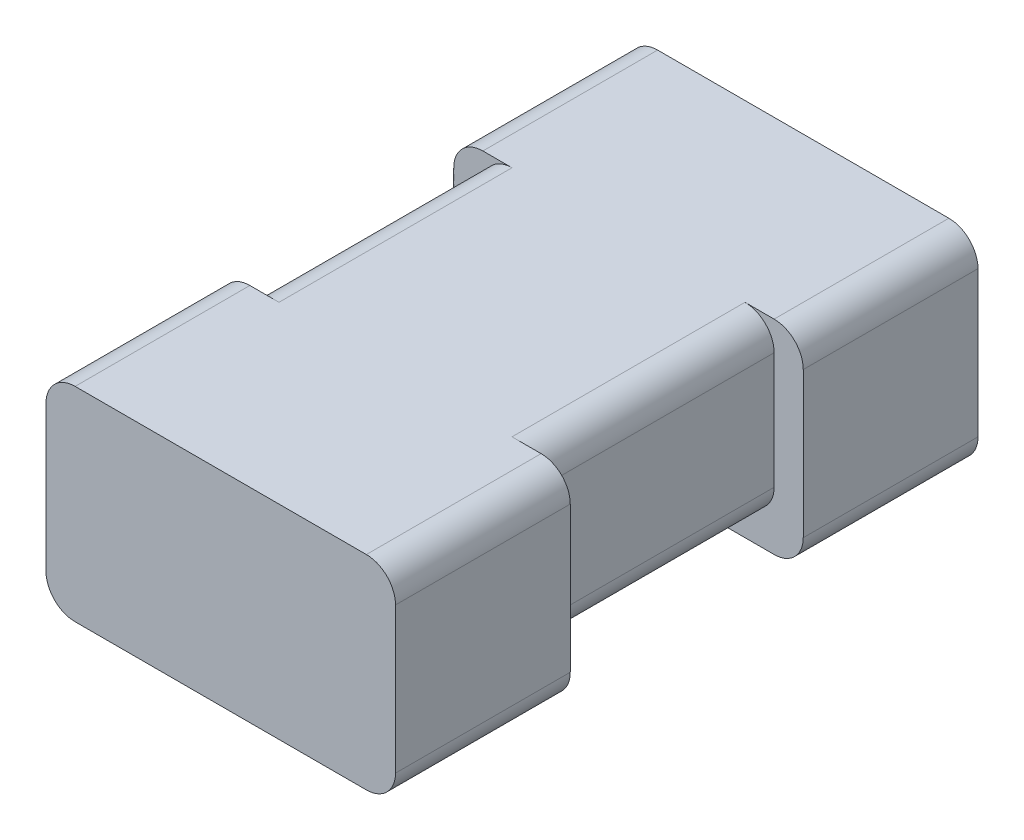
ISO-10303-21;
HEADER;
FILE_DESCRIPTION(('STEP AP214'),'2;1');
FILE_NAME('part.step','',(''),(''),'','','');
FILE_SCHEMA(('AUTOMOTIVE_DESIGN { 1 0 10303 214 1 1 1 1 }'));
ENDSEC;
DATA;
#1=APPLICATION_CONTEXT('core data for automotive mechanical design processes');
#2=APPLICATION_PROTOCOL_DEFINITION('international standard','automotive_design',2000,#1);
#3=PRODUCT_CONTEXT('',#1,'mechanical');
#4=PRODUCT('Part','Part','',(#3));
#5=PRODUCT_RELATED_PRODUCT_CATEGORY('part','',(#4));
#6=PRODUCT_DEFINITION_FORMATION('','',#4);
#7=PRODUCT_DEFINITION_CONTEXT('part definition',#1,'design');
#8=PRODUCT_DEFINITION('design','',#6,#7);
#9=PRODUCT_DEFINITION_SHAPE('','',#8);
#10=(LENGTH_UNIT() NAMED_UNIT(*) SI_UNIT(.MILLI.,.METRE.));
#11=(NAMED_UNIT(*) PLANE_ANGLE_UNIT() SI_UNIT($,.RADIAN.));
#12=(NAMED_UNIT(*) SI_UNIT($,.STERADIAN.) SOLID_ANGLE_UNIT());
#13=UNCERTAINTY_MEASURE_WITH_UNIT(LENGTH_MEASURE(1.E-05),#10,'distance_accuracy_value','');
#14=(GEOMETRIC_REPRESENTATION_CONTEXT(3) GLOBAL_UNCERTAINTY_ASSIGNED_CONTEXT((#13)) GLOBAL_UNIT_ASSIGNED_CONTEXT((#10,
#11,#12)) REPRESENTATION_CONTEXT('',''));
#15=CARTESIAN_POINT('',(0.,0.,0.));
#16=DIRECTION('',(0.,0.,1.));
#17=DIRECTION('',(1.,0.,0.));
#18=AXIS2_PLACEMENT_3D('',#15,#16,#17);
#19=CARTESIAN_POINT('',(0.,0.,0.4));
#20=DIRECTION('',(1.,0.,0.));
#21=DIRECTION('',(0.,1.,0.));
#22=AXIS2_PLACEMENT_3D('',#19,#20,#21);
#23=PLANE('',#22);
#24=DIRECTION('',(0.,-1.,0.));
#25=VECTOR('',#24,1.);
#26=CARTESIAN_POINT('',(0.,0.,0.));
#27=LINE('',#26,#25);
#28=CARTESIAN_POINT('',(0.,-0.05,0.));
#29=VERTEX_POINT('',#28);
#30=CARTESIAN_POINT('',(0.,-0.25,0.));
#31=VERTEX_POINT('',#30);
#32=EDGE_CURVE('E450',#29,#31,#27,.T.);
#33=ORIENTED_EDGE('',*,*,#32,.T.);
#34=DIRECTION('',(0.,0.,-1.));
#35=VECTOR('',#34,1.);
#36=CARTESIAN_POINT('',(0.,-0.25,0.4));
#37=LINE('',#36,#35);
#38=CARTESIAN_POINT('',(0.,-0.25,0.4));
#39=VERTEX_POINT('',#38);
#40=EDGE_CURVE('E309',#31,#39,#37,.F.);
#41=ORIENTED_EDGE('',*,*,#40,.T.);
#42=DIRECTION('',(0.,-1.,0.));
#43=VECTOR('',#42,1.);
#44=CARTESIAN_POINT('',(0.,0.,0.4));
#45=LINE('',#44,#43);
#46=CARTESIAN_POINT('',(0.,-0.05,0.4));
#47=VERTEX_POINT('',#46);
#48=EDGE_CURVE('E283',#47,#39,#45,.T.);
#49=ORIENTED_EDGE('',*,*,#48,.F.);
#50=DIRECTION('',(0.,0.,-1.));
#51=VECTOR('',#50,1.);
#52=CARTESIAN_POINT('',(0.,-0.05,0.4));
#53=LINE('',#52,#51);
#54=EDGE_CURVE('E305',#47,#29,#53,.T.);
#55=ORIENTED_EDGE('',*,*,#54,.T.);
#56=EDGE_LOOP('',(#33,#41,#49,#55));
#57=FACE_BOUND('',#56,.T.);
#58=ADVANCED_FACE('F42',(#57),#23,.F.);
#59=CARTESIAN_POINT('',(0.,-0.3,0.4));
#60=DIRECTION('',(0.,1.,0.));
#61=DIRECTION('',(0.,0.,1.));
#62=AXIS2_PLACEMENT_3D('',#59,#60,#61);
#63=PLANE('',#62);
#64=DIRECTION('',(1.,0.,0.));
#65=VECTOR('',#64,1.);
#66=CARTESIAN_POINT('',(0.,-0.3,0.));
#67=LINE('',#66,#65);
#68=CARTESIAN_POINT('',(0.05,-0.3,0.));
#69=VERTEX_POINT('',#68);
#70=CARTESIAN_POINT('',(0.45,-0.3,0.));
#71=VERTEX_POINT('',#70);
#72=EDGE_CURVE('E284',#69,#71,#67,.T.);
#73=ORIENTED_EDGE('',*,*,#72,.T.);
#74=DIRECTION('',(0.,0.,-1.));
#75=VECTOR('',#74,1.);
#76=CARTESIAN_POINT('',(0.45,-0.3,0.4));
#77=LINE('',#76,#75);
#78=CARTESIAN_POINT('',(0.45,-0.3,0.4));
#79=VERTEX_POINT('',#78);
#80=EDGE_CURVE('E302',#71,#79,#77,.F.);
#81=ORIENTED_EDGE('',*,*,#80,.T.);
#82=DIRECTION('',(1.,0.,0.));
#83=VECTOR('',#82,1.);
#84=CARTESIAN_POINT('',(0.,-0.3,0.4));
#85=LINE('',#84,#83);
#86=CARTESIAN_POINT('',(0.05,-0.3,0.4));
#87=VERTEX_POINT('',#86);
#88=EDGE_CURVE('E463',#87,#79,#85,.T.);
#89=ORIENTED_EDGE('',*,*,#88,.F.);
#90=DIRECTION('',(0.,0.,-1.));
#91=VECTOR('',#90,1.);
#92=CARTESIAN_POINT('',(0.05,-0.3,0.4));
#93=LINE('',#92,#91);
#94=EDGE_CURVE('E293',#87,#69,#93,.T.);
#95=ORIENTED_EDGE('',*,*,#94,.T.);
#96=EDGE_LOOP('',(#73,#81,#89,#95));
#97=FACE_BOUND('',#96,.T.);
#98=ADVANCED_FACE('F515',(#97),#63,.F.);
#99=CARTESIAN_POINT('',(0.5,0.,0.4));
#100=DIRECTION('',(-1.,0.,0.));
#101=DIRECTION('',(0.,0.,1.));
#102=AXIS2_PLACEMENT_3D('',#99,#100,#101);
#103=PLANE('',#102);
#104=DIRECTION('',(0.,1.,0.));
#105=VECTOR('',#104,1.);
#106=CARTESIAN_POINT('',(0.5,0.,0.4));
#107=LINE('',#106,#105);
#108=CARTESIAN_POINT('',(0.5,-0.25,0.4));
#109=VERTEX_POINT('',#108);
#110=CARTESIAN_POINT('',(0.5,-0.05,0.4));
#111=VERTEX_POINT('',#110);
#112=EDGE_CURVE('E467',#109,#111,#107,.T.);
#113=ORIENTED_EDGE('',*,*,#112,.F.);
#114=DIRECTION('',(0.,0.,-1.));
#115=VECTOR('',#114,1.);
#116=CARTESIAN_POINT('',(0.5,-0.25,0.4));
#117=LINE('',#116,#115);
#118=CARTESIAN_POINT('',(0.5,-0.25,0.));
#119=VERTEX_POINT('',#118);
#120=EDGE_CURVE('E281',#109,#119,#117,.T.);
#121=ORIENTED_EDGE('',*,*,#120,.T.);
#122=DIRECTION('',(0.,1.,0.));
#123=VECTOR('',#122,1.);
#124=CARTESIAN_POINT('',(0.5,0.,0.));
#125=LINE('',#124,#123);
#126=CARTESIAN_POINT('',(0.5,-0.05,0.));
#127=VERTEX_POINT('',#126);
#128=EDGE_CURVE('E271',#119,#127,#125,.T.);
#129=ORIENTED_EDGE('',*,*,#128,.T.);
#130=DIRECTION('',(0.,0.,-1.));
#131=VECTOR('',#130,1.);
#132=CARTESIAN_POINT('',(0.5,-0.05,0.4));
#133=LINE('',#132,#131);
#134=EDGE_CURVE('E278',#127,#111,#133,.F.);
#135=ORIENTED_EDGE('',*,*,#134,.T.);
#136=EDGE_LOOP('',(#113,#121,#129,#135));
#137=FACE_BOUND('',#136,.T.);
#138=ADVANCED_FACE('F277',(#137),#103,.F.);
#139=CARTESIAN_POINT('',(0.,0.,0.4));
#140=DIRECTION('',(0.,-1.,0.));
#141=DIRECTION('',(0.,0.,-1.));
#142=AXIS2_PLACEMENT_3D('',#139,#140,#141);
#143=PLANE('',#142);
#144=DIRECTION('',(-1.,0.,0.));
#145=VECTOR('',#144,1.);
#146=CARTESIAN_POINT('',(-0.05,0.,0.7));
#147=LINE('',#146,#145);
#148=CARTESIAN_POINT('',(0.5,0.,0.7));
#149=VERTEX_POINT('',#148);
#150=CARTESIAN_POINT('',(0.,0.,0.7));
#151=VERTEX_POINT('',#150);
#152=EDGE_CURVE('E447',#149,#151,#147,.T.);
#153=ORIENTED_EDGE('',*,*,#152,.F.);
#154=DIRECTION('',(0.,0.,-1.));
#155=VECTOR('',#154,1.);
#156=CARTESIAN_POINT('',(0.5,0.,0.4));
#157=LINE('',#156,#155);
#158=CARTESIAN_POINT('',(0.5,0.,0.4));
#159=VERTEX_POINT('',#158);
#160=EDGE_CURVE('E247',#149,#159,#157,.T.);
#161=ORIENTED_EDGE('',*,*,#160,.T.);
#162=DIRECTION('',(-1.,0.,0.));
#163=VECTOR('',#162,1.);
#164=CARTESIAN_POINT('',(-0.05,0.,0.4));
#165=LINE('',#164,#163);
#166=CARTESIAN_POINT('',(0.45,0.,0.4));
#167=VERTEX_POINT('',#166);
#168=EDGE_CURVE('E244',#159,#167,#165,.T.);
#169=ORIENTED_EDGE('',*,*,#168,.T.);
#170=DIRECTION('',(0.,0.,-1.));
#171=VECTOR('',#170,1.);
#172=CARTESIAN_POINT('',(0.45,0.,0.4));
#173=LINE('',#172,#171);
#174=CARTESIAN_POINT('',(0.45,0.,0.));
#175=VERTEX_POINT('',#174);
#176=EDGE_CURVE('E215',#167,#175,#173,.T.);
#177=ORIENTED_EDGE('',*,*,#176,.T.);
#178=DIRECTION('',(1.,0.,0.));
#179=VECTOR('',#178,1.);
#180=CARTESIAN_POINT('',(0.55,0.,0.));
#181=LINE('',#180,#179);
#182=CARTESIAN_POINT('',(0.5,0.,0.));
#183=VERTEX_POINT('',#182);
#184=EDGE_CURVE('E205',#175,#183,#181,.T.);
#185=ORIENTED_EDGE('',*,*,#184,.T.);
#186=DIRECTION('',(0.,0.,1.));
#187=VECTOR('',#186,1.);
#188=CARTESIAN_POINT('',(0.5,0.,0.4));
#189=LINE('',#188,#187);
#190=CARTESIAN_POINT('',(0.5,0.,-0.3));
#191=VERTEX_POINT('',#190);
#192=EDGE_CURVE('E211',#183,#191,#189,.F.);
#193=ORIENTED_EDGE('',*,*,#192,.T.);
#194=DIRECTION('',(1.,0.,0.));
#195=VECTOR('',#194,1.);
#196=CARTESIAN_POINT('',(0.55,0.,-0.3));
#197=LINE('',#196,#195);
#198=CARTESIAN_POINT('',(0.,0.,-0.3));
#199=VERTEX_POINT('',#198);
#200=EDGE_CURVE('E427',#199,#191,#197,.T.);
#201=ORIENTED_EDGE('',*,*,#200,.F.);
#202=DIRECTION('',(0.,0.,1.));
#203=VECTOR('',#202,1.);
#204=CARTESIAN_POINT('',(0.,0.,0.4));
#205=LINE('',#204,#203);
#206=CARTESIAN_POINT('',(0.,0.,0.));
#207=VERTEX_POINT('',#206);
#208=EDGE_CURVE('E312',#199,#207,#205,.T.);
#209=ORIENTED_EDGE('',*,*,#208,.T.);
#210=DIRECTION('',(1.,0.,0.));
#211=VECTOR('',#210,1.);
#212=CARTESIAN_POINT('',(0.55,0.,0.));
#213=LINE('',#212,#211);
#214=CARTESIAN_POINT('',(0.05,0.,0.));
#215=VERTEX_POINT('',#214);
#216=EDGE_CURVE('E316',#207,#215,#213,.T.);
#217=ORIENTED_EDGE('',*,*,#216,.T.);
#218=DIRECTION('',(0.,0.,-1.));
#219=VECTOR('',#218,1.);
#220=CARTESIAN_POINT('',(0.05,0.,0.4));
#221=LINE('',#220,#219);
#222=CARTESIAN_POINT('',(0.05,0.,0.4));
#223=VERTEX_POINT('',#222);
#224=EDGE_CURVE('E320',#215,#223,#221,.F.);
#225=ORIENTED_EDGE('',*,*,#224,.T.);
#226=DIRECTION('',(-1.,0.,0.));
#227=VECTOR('',#226,1.);
#228=CARTESIAN_POINT('',(-0.05,0.,0.4));
#229=LINE('',#228,#227);
#230=CARTESIAN_POINT('',(0.,0.,0.4));
#231=VERTEX_POINT('',#230);
#232=EDGE_CURVE('E238',#223,#231,#229,.T.);
#233=ORIENTED_EDGE('',*,*,#232,.T.);
#234=DIRECTION('',(0.,0.,-1.));
#235=VECTOR('',#234,1.);
#236=CARTESIAN_POINT('',(0.,0.,0.4));
#237=LINE('',#236,#235);
#238=EDGE_CURVE('E235',#231,#151,#237,.F.);
#239=ORIENTED_EDGE('',*,*,#238,.T.);
#240=EDGE_LOOP('',(#153,#161,#169,#177,#185,#193,#201,#209,#217,#225,#233,#239));
#241=FACE_BOUND('',#240,.T.);
#242=ADVANCED_FACE('F208',(#241),#143,.F.);
#243=CARTESIAN_POINT('',(0.,0.,0.4));
#244=DIRECTION('',(0.,0.,1.));
#245=DIRECTION('',(1.,0.,0.));
#246=AXIS2_PLACEMENT_3D('',#243,#244,#245);
#247=PLANE('',#246);
#248=DIRECTION('',(0.,1.,0.));
#249=VECTOR('',#248,1.);
#250=CARTESIAN_POINT('',(0.55,0.,0.4));
#251=LINE('',#250,#249);
#252=CARTESIAN_POINT('',(0.55,-0.3,0.4));
#253=VERTEX_POINT('',#252);
#254=CARTESIAN_POINT('',(0.55,-0.05,0.4));
#255=VERTEX_POINT('',#254);
#256=EDGE_CURVE('E439',#253,#255,#251,.T.);
#257=ORIENTED_EDGE('',*,*,#256,.F.);
#258=CARTESIAN_POINT('',(0.5,-0.3,0.4));
#259=DIRECTION('',(0.,0.,1.));
#260=DIRECTION('',(1.,0.,0.));
#261=AXIS2_PLACEMENT_3D('',#258,#259,#260);
#262=CIRCLE('',#261,0.05);
#263=CARTESIAN_POINT('',(0.5,-0.35,0.4));
#264=VERTEX_POINT('',#263);
#265=EDGE_CURVE('E487',#253,#264,#262,.F.);
#266=ORIENTED_EDGE('',*,*,#265,.T.);
#267=DIRECTION('',(1.,0.,0.));
#268=VECTOR('',#267,1.);
#269=CARTESIAN_POINT('',(-0.0499999999999999,-0.35,0.4));
#270=LINE('',#269,#268);
#271=CARTESIAN_POINT('',(0.,-0.35,0.4));
#272=VERTEX_POINT('',#271);
#273=EDGE_CURVE('E453',#272,#264,#270,.T.);
#274=ORIENTED_EDGE('',*,*,#273,.F.);
#275=CARTESIAN_POINT('',(0.,-0.3,0.4));
#276=DIRECTION('',(0.,0.,1.));
#277=DIRECTION('',(1.,0.,0.));
#278=AXIS2_PLACEMENT_3D('',#275,#276,#277);
#279=CIRCLE('',#278,0.05);
#280=CARTESIAN_POINT('',(-0.0499999999999999,-0.3,0.4));
#281=VERTEX_POINT('',#280);
#282=EDGE_CURVE('E484',#272,#281,#279,.F.);
#283=ORIENTED_EDGE('',*,*,#282,.T.);
#284=DIRECTION('',(0.,-1.,0.));
#285=VECTOR('',#284,1.);
#286=CARTESIAN_POINT('',(-0.05,0.,0.4));
#287=LINE('',#286,#285);
#288=CARTESIAN_POINT('',(-0.05,-0.05,0.4));
#289=VERTEX_POINT('',#288);
#290=EDGE_CURVE('E335',#289,#281,#287,.T.);
#291=ORIENTED_EDGE('',*,*,#290,.F.);
#292=CARTESIAN_POINT('',(0.,-0.05,0.4));
#293=DIRECTION('',(0.,0.,1.));
#294=DIRECTION('',(1.,0.,0.));
#295=AXIS2_PLACEMENT_3D('',#292,#293,#294);
#296=CIRCLE('',#295,0.05);
#297=EDGE_CURVE('E331',#289,#231,#296,.F.);
#298=ORIENTED_EDGE('',*,*,#297,.T.);
#299=ORIENTED_EDGE('',*,*,#232,.F.);
#300=CARTESIAN_POINT('',(0.05,-0.05,0.4));
#301=DIRECTION('',(0.,0.,1.));
#302=DIRECTION('',(1.,0.,0.));
#303=AXIS2_PLACEMENT_3D('',#300,#301,#302);
#304=CIRCLE('',#303,0.05);
#305=EDGE_CURVE('E266',#223,#47,#304,.T.);
#306=ORIENTED_EDGE('',*,*,#305,.T.);
#307=ORIENTED_EDGE('',*,*,#48,.T.);
#308=CARTESIAN_POINT('',(0.05,-0.25,0.4));
#309=DIRECTION('',(0.,0.,1.));
#310=DIRECTION('',(1.,0.,0.));
#311=AXIS2_PLACEMENT_3D('',#308,#309,#310);
#312=CIRCLE('',#311,0.05);
#313=EDGE_CURVE('E260',#39,#87,#312,.T.);
#314=ORIENTED_EDGE('',*,*,#313,.T.);
#315=ORIENTED_EDGE('',*,*,#88,.T.);
#316=CARTESIAN_POINT('',(0.45,-0.25,0.4));
#317=DIRECTION('',(0.,0.,1.));
#318=DIRECTION('',(1.,0.,0.));
#319=AXIS2_PLACEMENT_3D('',#316,#317,#318);
#320=CIRCLE('',#319,0.05);
#321=EDGE_CURVE('E254',#79,#109,#320,.T.);
#322=ORIENTED_EDGE('',*,*,#321,.T.);
#323=ORIENTED_EDGE('',*,*,#112,.T.);
#324=CARTESIAN_POINT('',(0.45,-0.05,0.4));
#325=DIRECTION('',(0.,0.,1.));
#326=DIRECTION('',(1.,0.,0.));
#327=AXIS2_PLACEMENT_3D('',#324,#325,#326);
#328=CIRCLE('',#327,0.05);
#329=EDGE_CURVE('E11',#111,#167,#328,.T.);
#330=ORIENTED_EDGE('',*,*,#329,.T.);
#331=ORIENTED_EDGE('',*,*,#168,.F.);
#332=CARTESIAN_POINT('',(0.5,-0.05,0.4));
#333=DIRECTION('',(0.,0.,1.));
#334=DIRECTION('',(1.,0.,0.));
#335=AXIS2_PLACEMENT_3D('',#332,#333,#334);
#336=CIRCLE('',#335,0.05);
#337=EDGE_CURVE('E58',#159,#255,#336,.F.);
#338=ORIENTED_EDGE('',*,*,#337,.T.);
#339=EDGE_LOOP('',(#257,#266,#274,#283,#291,#298,#299,#306,#307,#314,#315,#322,#323,#330,#331,#338));
#340=FACE_BOUND('',#339,.T.);
#341=ADVANCED_FACE('F333',(#340),#247,.F.);
#342=CARTESIAN_POINT('',(-0.05,0.,0.7));
#343=DIRECTION('',(1.,0.,0.));
#344=DIRECTION('',(0.,1.,0.));
#345=AXIS2_PLACEMENT_3D('',#342,#343,#344);
#346=PLANE('',#345);
#347=ORIENTED_EDGE('',*,*,#290,.T.);
#348=DIRECTION('',(0.,0.,-1.));
#349=VECTOR('',#348,1.);
#350=CARTESIAN_POINT('',(-0.0499999999999999,-0.3,0.7));
#351=LINE('',#350,#349);
#352=CARTESIAN_POINT('',(-0.0499999999999999,-0.3,0.7));
#353=VERTEX_POINT('',#352);
#354=EDGE_CURVE('E368',#281,#353,#351,.F.);
#355=ORIENTED_EDGE('',*,*,#354,.T.);
#356=DIRECTION('',(0.,-1.,0.));
#357=VECTOR('',#356,1.);
#358=CARTESIAN_POINT('',(-0.05,0.,0.7));
#359=LINE('',#358,#357);
#360=CARTESIAN_POINT('',(-0.05,-0.05,0.7));
#361=VERTEX_POINT('',#360);
#362=EDGE_CURVE('E435',#361,#353,#359,.T.);
#363=ORIENTED_EDGE('',*,*,#362,.F.);
#364=DIRECTION('',(0.,0.,-1.));
#365=VECTOR('',#364,1.);
#366=CARTESIAN_POINT('',(-0.05,-0.05,0.7));
#367=LINE('',#366,#365);
#368=EDGE_CURVE('E345',#361,#289,#367,.T.);
#369=ORIENTED_EDGE('',*,*,#368,.T.);
#370=EDGE_LOOP('',(#347,#355,#363,#369));
#371=FACE_BOUND('',#370,.T.);
#372=ADVANCED_FACE('F569',(#371),#346,.F.);
#373=CARTESIAN_POINT('',(-0.0499999999999999,-0.35,0.7));
#374=DIRECTION('',(0.,1.,0.));
#375=DIRECTION('',(0.,0.,1.));
#376=AXIS2_PLACEMENT_3D('',#373,#374,#375);
#377=PLANE('',#376);
#378=ORIENTED_EDGE('',*,*,#273,.T.);
#379=DIRECTION('',(0.,0.,-1.));
#380=VECTOR('',#379,1.);
#381=CARTESIAN_POINT('',(0.5,-0.35,0.7));
#382=LINE('',#381,#380);
#383=CARTESIAN_POINT('',(0.5,-0.35,0.7));
#384=VERTEX_POINT('',#383);
#385=EDGE_CURVE('E351',#264,#384,#382,.F.);
#386=ORIENTED_EDGE('',*,*,#385,.T.);
#387=DIRECTION('',(1.,0.,0.));
#388=VECTOR('',#387,1.);
#389=CARTESIAN_POINT('',(-0.0499999999999999,-0.35,0.7));
#390=LINE('',#389,#388);
#391=CARTESIAN_POINT('',(0.,-0.35,0.7));
#392=VERTEX_POINT('',#391);
#393=EDGE_CURVE('E438',#392,#384,#390,.T.);
#394=ORIENTED_EDGE('',*,*,#393,.F.);
#395=DIRECTION('',(0.,0.,-1.));
#396=VECTOR('',#395,1.);
#397=CARTESIAN_POINT('',(0.,-0.35,0.7));
#398=LINE('',#397,#396);
#399=EDGE_CURVE('E357',#392,#272,#398,.T.);
#400=ORIENTED_EDGE('',*,*,#399,.T.);
#401=EDGE_LOOP('',(#378,#386,#394,#400));
#402=FACE_BOUND('',#401,.T.);
#403=ADVANCED_FACE('F495',(#402),#377,.F.);
#404=CARTESIAN_POINT('',(0.55,0.,0.7));
#405=DIRECTION('',(-1.,0.,0.));
#406=DIRECTION('',(0.,0.,1.));
#407=AXIS2_PLACEMENT_3D('',#404,#405,#406);
#408=PLANE('',#407);
#409=DIRECTION('',(0.,1.,0.));
#410=VECTOR('',#409,1.);
#411=CARTESIAN_POINT('',(0.55,0.,0.7));
#412=LINE('',#411,#410);
#413=CARTESIAN_POINT('',(0.55,-0.3,0.7));
#414=VERTEX_POINT('',#413);
#415=CARTESIAN_POINT('',(0.55,-0.05,0.7));
#416=VERTEX_POINT('',#415);
#417=EDGE_CURVE('E443',#414,#416,#412,.T.);
#418=ORIENTED_EDGE('',*,*,#417,.F.);
#419=DIRECTION('',(0.,0.,-1.));
#420=VECTOR('',#419,1.);
#421=CARTESIAN_POINT('',(0.55,-0.3,0.7));
#422=LINE('',#421,#420);
#423=EDGE_CURVE('E340',#414,#253,#422,.T.);
#424=ORIENTED_EDGE('',*,*,#423,.T.);
#425=ORIENTED_EDGE('',*,*,#256,.T.);
#426=DIRECTION('',(0.,0.,-1.));
#427=VECTOR('',#426,1.);
#428=CARTESIAN_POINT('',(0.55,-0.05,0.7));
#429=LINE('',#428,#427);
#430=EDGE_CURVE('E470',#255,#416,#429,.F.);
#431=ORIENTED_EDGE('',*,*,#430,.T.);
#432=EDGE_LOOP('',(#418,#424,#425,#431));
#433=FACE_BOUND('',#432,.T.);
#434=ADVANCED_FACE('F505',(#433),#408,.F.);
#435=CARTESIAN_POINT('',(0.,0.,0.7));
#436=DIRECTION('',(0.,0.,1.));
#437=DIRECTION('',(1.,0.,0.));
#438=AXIS2_PLACEMENT_3D('',#435,#436,#437);
#439=PLANE('',#438);
#440=ORIENTED_EDGE('',*,*,#393,.T.);
#441=CARTESIAN_POINT('',(0.5,-0.3,0.7));
#442=DIRECTION('',(0.,0.,1.));
#443=DIRECTION('',(1.,0.,0.));
#444=AXIS2_PLACEMENT_3D('',#441,#442,#443);
#445=CIRCLE('',#444,0.05);
#446=EDGE_CURVE('E363',#384,#414,#445,.T.);
#447=ORIENTED_EDGE('',*,*,#446,.T.);
#448=ORIENTED_EDGE('',*,*,#417,.T.);
#449=CARTESIAN_POINT('',(0.5,-0.05,0.7));
#450=DIRECTION('',(0.,0.,1.));
#451=DIRECTION('',(1.,0.,0.));
#452=AXIS2_PLACEMENT_3D('',#449,#450,#451);
#453=CIRCLE('',#452,0.05);
#454=EDGE_CURVE('E350',#416,#149,#453,.T.);
#455=ORIENTED_EDGE('',*,*,#454,.T.);
#456=ORIENTED_EDGE('',*,*,#152,.T.);
#457=CARTESIAN_POINT('',(0.,-0.05,0.7));
#458=DIRECTION('',(0.,0.,1.));
#459=DIRECTION('',(1.,0.,0.));
#460=AXIS2_PLACEMENT_3D('',#457,#458,#459);
#461=CIRCLE('',#460,0.05);
#462=EDGE_CURVE('E344',#151,#361,#461,.T.);
#463=ORIENTED_EDGE('',*,*,#462,.T.);
#464=ORIENTED_EDGE('',*,*,#362,.T.);
#465=CARTESIAN_POINT('',(0.,-0.3,0.7));
#466=DIRECTION('',(0.,0.,1.));
#467=DIRECTION('',(1.,0.,0.));
#468=AXIS2_PLACEMENT_3D('',#465,#466,#467);
#469=CIRCLE('',#468,0.05);
#470=EDGE_CURVE('E355',#353,#392,#469,.T.);
#471=ORIENTED_EDGE('',*,*,#470,.T.);
#472=EDGE_LOOP('',(#440,#447,#448,#455,#456,#463,#464,#471));
#473=FACE_BOUND('',#472,.T.);
#474=ADVANCED_FACE('F507',(#473),#439,.T.);
#475=CARTESIAN_POINT('',(0.55,0.,-0.3));
#476=DIRECTION('',(-1.,0.,0.));
#477=DIRECTION('',(0.,0.,1.));
#478=AXIS2_PLACEMENT_3D('',#475,#476,#477);
#479=PLANE('',#478);
#480=DIRECTION('',(0.,-1.,0.));
#481=VECTOR('',#480,1.);
#482=CARTESIAN_POINT('',(0.55,0.,0.));
#483=LINE('',#482,#481);
#484=CARTESIAN_POINT('',(0.55,-0.05,0.));
#485=VERTEX_POINT('',#484);
#486=CARTESIAN_POINT('',(0.55,-0.3,0.));
#487=VERTEX_POINT('',#486);
#488=EDGE_CURVE('E224',#485,#487,#483,.T.);
#489=ORIENTED_EDGE('',*,*,#488,.T.);
#490=DIRECTION('',(0.,0.,1.));
#491=VECTOR('',#490,1.);
#492=CARTESIAN_POINT('',(0.55,-0.3,-0.3));
#493=LINE('',#492,#491);
#494=CARTESIAN_POINT('',(0.55,-0.3,-0.3));
#495=VERTEX_POINT('',#494);
#496=EDGE_CURVE('E289',#487,#495,#493,.F.);
#497=ORIENTED_EDGE('',*,*,#496,.T.);
#498=DIRECTION('',(0.,-1.,0.));
#499=VECTOR('',#498,1.);
#500=CARTESIAN_POINT('',(0.55,0.,-0.3));
#501=LINE('',#500,#499);
#502=CARTESIAN_POINT('',(0.55,-0.05,-0.3));
#503=VERTEX_POINT('',#502);
#504=EDGE_CURVE('E408',#503,#495,#501,.T.);
#505=ORIENTED_EDGE('',*,*,#504,.F.);
#506=DIRECTION('',(0.,0.,1.));
#507=VECTOR('',#506,1.);
#508=CARTESIAN_POINT('',(0.55,-0.05,-0.3));
#509=LINE('',#508,#507);
#510=EDGE_CURVE('E295',#503,#485,#509,.T.);
#511=ORIENTED_EDGE('',*,*,#510,.T.);
#512=EDGE_LOOP('',(#489,#497,#505,#511));
#513=FACE_BOUND('',#512,.T.);
#514=ADVANCED_FACE('F405',(#513),#479,.F.);
#515=CARTESIAN_POINT('',(0.55,-0.35,-0.3));
#516=DIRECTION('',(0.,1.,0.));
#517=DIRECTION('',(0.,0.,1.));
#518=AXIS2_PLACEMENT_3D('',#515,#516,#517);
#519=PLANE('',#518);
#520=DIRECTION('',(-1.,0.,0.));
#521=VECTOR('',#520,1.);
#522=CARTESIAN_POINT('',(0.55,-0.35,0.));
#523=LINE('',#522,#521);
#524=CARTESIAN_POINT('',(0.5,-0.35,0.));
#525=VERTEX_POINT('',#524);
#526=CARTESIAN_POINT('',(0.,-0.35,0.));
#527=VERTEX_POINT('',#526);
#528=EDGE_CURVE('E421',#525,#527,#523,.T.);
#529=ORIENTED_EDGE('',*,*,#528,.T.);
#530=DIRECTION('',(0.,0.,1.));
#531=VECTOR('',#530,1.);
#532=CARTESIAN_POINT('',(0.,-0.35,-0.3));
#533=LINE('',#532,#531);
#534=CARTESIAN_POINT('',(0.,-0.35,-0.3));
#535=VERTEX_POINT('',#534);
#536=EDGE_CURVE('E389',#527,#535,#533,.F.);
#537=ORIENTED_EDGE('',*,*,#536,.T.);
#538=DIRECTION('',(-1.,0.,0.));
#539=VECTOR('',#538,1.);
#540=CARTESIAN_POINT('',(0.55,-0.35,-0.3));
#541=LINE('',#540,#539);
#542=CARTESIAN_POINT('',(0.5,-0.35,-0.3));
#543=VERTEX_POINT('',#542);
#544=EDGE_CURVE('E412',#543,#535,#541,.T.);
#545=ORIENTED_EDGE('',*,*,#544,.F.);
#546=DIRECTION('',(0.,0.,1.));
#547=VECTOR('',#546,1.);
#548=CARTESIAN_POINT('',(0.5,-0.35,-0.3));
#549=LINE('',#548,#547);
#550=EDGE_CURVE('E385',#543,#525,#549,.T.);
#551=ORIENTED_EDGE('',*,*,#550,.T.);
#552=EDGE_LOOP('',(#529,#537,#545,#551));
#553=FACE_BOUND('',#552,.T.);
#554=ADVANCED_FACE('F540',(#553),#519,.F.);
#555=CARTESIAN_POINT('',(-0.0499999999999999,0.,-0.3));
#556=DIRECTION('',(1.,0.,0.));
#557=DIRECTION('',(0.,0.,-1.));
#558=AXIS2_PLACEMENT_3D('',#555,#556,#557);
#559=PLANE('',#558);
#560=DIRECTION('',(0.,1.,0.));
#561=VECTOR('',#560,1.);
#562=CARTESIAN_POINT('',(-0.0499999999999999,0.,-0.3));
#563=LINE('',#562,#561);
#564=CARTESIAN_POINT('',(-0.0499999999999999,-0.3,-0.3));
#565=VERTEX_POINT('',#564);
#566=CARTESIAN_POINT('',(-0.0499999999999999,-0.05,-0.3));
#567=VERTEX_POINT('',#566);
#568=EDGE_CURVE('E418',#565,#567,#563,.T.);
#569=ORIENTED_EDGE('',*,*,#568,.F.);
#570=DIRECTION('',(0.,0.,1.));
#571=VECTOR('',#570,1.);
#572=CARTESIAN_POINT('',(-0.0499999999999999,-0.3,-0.3));
#573=LINE('',#572,#571);
#574=CARTESIAN_POINT('',(-0.0499999999999999,-0.3,0.));
#575=VERTEX_POINT('',#574);
#576=EDGE_CURVE('E374',#565,#575,#573,.T.);
#577=ORIENTED_EDGE('',*,*,#576,.T.);
#578=DIRECTION('',(0.,1.,0.));
#579=VECTOR('',#578,1.);
#580=CARTESIAN_POINT('',(-0.0499999999999999,0.,0.));
#581=LINE('',#580,#579);
#582=CARTESIAN_POINT('',(-0.0499999999999999,-0.05,0.));
#583=VERTEX_POINT('',#582);
#584=EDGE_CURVE('E413',#575,#583,#581,.T.);
#585=ORIENTED_EDGE('',*,*,#584,.T.);
#586=DIRECTION('',(0.,0.,1.));
#587=VECTOR('',#586,1.);
#588=CARTESIAN_POINT('',(-0.0499999999999999,-0.05,-0.3));
#589=LINE('',#588,#587);
#590=EDGE_CURVE('E371',#583,#567,#589,.F.);
#591=ORIENTED_EDGE('',*,*,#590,.T.);
#592=EDGE_LOOP('',(#569,#577,#585,#591));
#593=FACE_BOUND('',#592,.T.);
#594=ADVANCED_FACE('F534',(#593),#559,.F.);
#595=CARTESIAN_POINT('',(0.,0.,-0.3));
#596=DIRECTION('',(0.,0.,-1.));
#597=DIRECTION('',(-1.,0.,0.));
#598=AXIS2_PLACEMENT_3D('',#595,#596,#597);
#599=PLANE('',#598);
#600=ORIENTED_EDGE('',*,*,#544,.T.);
#601=CARTESIAN_POINT('',(0.,-0.3,-0.3));
#602=DIRECTION('',(0.,0.,-1.));
#603=DIRECTION('',(-1.,0.,0.));
#604=AXIS2_PLACEMENT_3D('',#601,#602,#603);
#605=CIRCLE('',#604,0.05);
#606=EDGE_CURVE('E400',#535,#565,#605,.T.);
#607=ORIENTED_EDGE('',*,*,#606,.T.);
#608=ORIENTED_EDGE('',*,*,#568,.T.);
#609=CARTESIAN_POINT('',(0.,-0.05,-0.3));
#610=DIRECTION('',(0.,0.,-1.));
#611=DIRECTION('',(-1.,0.,0.));
#612=AXIS2_PLACEMENT_3D('',#609,#610,#611);
#613=CIRCLE('',#612,0.05);
#614=EDGE_CURVE('E392',#567,#199,#613,.T.);
#615=ORIENTED_EDGE('',*,*,#614,.T.);
#616=ORIENTED_EDGE('',*,*,#200,.T.);
#617=CARTESIAN_POINT('',(0.5,-0.05,-0.3));
#618=DIRECTION('',(0.,0.,-1.));
#619=DIRECTION('',(-1.,0.,0.));
#620=AXIS2_PLACEMENT_3D('',#617,#618,#619);
#621=CIRCLE('',#620,0.05);
#622=EDGE_CURVE('E233',#191,#503,#621,.T.);
#623=ORIENTED_EDGE('',*,*,#622,.T.);
#624=ORIENTED_EDGE('',*,*,#504,.T.);
#625=CARTESIAN_POINT('',(0.5,-0.3,-0.3));
#626=DIRECTION('',(0.,0.,-1.));
#627=DIRECTION('',(-1.,0.,0.));
#628=AXIS2_PLACEMENT_3D('',#625,#626,#627);
#629=CIRCLE('',#628,0.05);
#630=EDGE_CURVE('E397',#495,#543,#629,.T.);
#631=ORIENTED_EDGE('',*,*,#630,.T.);
#632=EDGE_LOOP('',(#600,#607,#608,#615,#616,#623,#624,#631));
#633=FACE_BOUND('',#632,.T.);
#634=ADVANCED_FACE('F529',(#633),#599,.T.);
#635=CARTESIAN_POINT('',(0.,0.,0.));
#636=DIRECTION('',(0.,0.,-1.));
#637=DIRECTION('',(-1.,0.,0.));
#638=AXIS2_PLACEMENT_3D('',#635,#636,#637);
#639=PLANE('',#638);
#640=ORIENTED_EDGE('',*,*,#584,.F.);
#641=CARTESIAN_POINT('',(0.,-0.3,0.));
#642=DIRECTION('',(0.,0.,-1.));
#643=DIRECTION('',(-1.,0.,0.));
#644=AXIS2_PLACEMENT_3D('',#641,#642,#643);
#645=CIRCLE('',#644,0.05);
#646=EDGE_CURVE('E382',#575,#527,#645,.F.);
#647=ORIENTED_EDGE('',*,*,#646,.T.);
#648=ORIENTED_EDGE('',*,*,#528,.F.);
#649=CARTESIAN_POINT('',(0.5,-0.3,0.));
#650=DIRECTION('',(0.,0.,-1.));
#651=DIRECTION('',(-1.,0.,0.));
#652=AXIS2_PLACEMENT_3D('',#649,#650,#651);
#653=CIRCLE('',#652,0.05);
#654=EDGE_CURVE('E229',#525,#487,#653,.F.);
#655=ORIENTED_EDGE('',*,*,#654,.T.);
#656=ORIENTED_EDGE('',*,*,#488,.F.);
#657=CARTESIAN_POINT('',(0.5,-0.05,0.));
#658=DIRECTION('',(0.,0.,-1.));
#659=DIRECTION('',(-1.,0.,0.));
#660=AXIS2_PLACEMENT_3D('',#657,#658,#659);
#661=CIRCLE('',#660,0.05);
#662=EDGE_CURVE('E220',#485,#183,#661,.F.);
#663=ORIENTED_EDGE('',*,*,#662,.T.);
#664=ORIENTED_EDGE('',*,*,#184,.F.);
#665=CARTESIAN_POINT('',(0.45,-0.05,0.));
#666=DIRECTION('',(0.,0.,-1.));
#667=DIRECTION('',(-1.,0.,0.));
#668=AXIS2_PLACEMENT_3D('',#665,#666,#667);
#669=CIRCLE('',#668,0.05);
#670=EDGE_CURVE('E51',#175,#127,#669,.T.);
#671=ORIENTED_EDGE('',*,*,#670,.T.);
#672=ORIENTED_EDGE('',*,*,#128,.F.);
#673=CARTESIAN_POINT('',(0.45,-0.25,0.));
#674=DIRECTION('',(0.,0.,-1.));
#675=DIRECTION('',(-1.,0.,0.));
#676=AXIS2_PLACEMENT_3D('',#673,#674,#675);
#677=CIRCLE('',#676,0.05);
#678=EDGE_CURVE('E251',#119,#71,#677,.T.);
#679=ORIENTED_EDGE('',*,*,#678,.T.);
#680=ORIENTED_EDGE('',*,*,#72,.F.);
#681=CARTESIAN_POINT('',(0.05,-0.25,0.));
#682=DIRECTION('',(0.,0.,-1.));
#683=DIRECTION('',(-1.,0.,0.));
#684=AXIS2_PLACEMENT_3D('',#681,#682,#683);
#685=CIRCLE('',#684,0.05);
#686=EDGE_CURVE('E257',#69,#31,#685,.T.);
#687=ORIENTED_EDGE('',*,*,#686,.T.);
#688=ORIENTED_EDGE('',*,*,#32,.F.);
#689=CARTESIAN_POINT('',(0.05,-0.05,0.));
#690=DIRECTION('',(0.,0.,-1.));
#691=DIRECTION('',(-1.,0.,0.));
#692=AXIS2_PLACEMENT_3D('',#689,#690,#691);
#693=CIRCLE('',#692,0.05);
#694=EDGE_CURVE('E263',#29,#215,#693,.T.);
#695=ORIENTED_EDGE('',*,*,#694,.T.);
#696=ORIENTED_EDGE('',*,*,#216,.F.);
#697=CARTESIAN_POINT('',(0.,-0.05,0.));
#698=DIRECTION('',(0.,0.,-1.));
#699=DIRECTION('',(-1.,0.,0.));
#700=AXIS2_PLACEMENT_3D('',#697,#698,#699);
#701=CIRCLE('',#700,0.05);
#702=EDGE_CURVE('E66',#207,#583,#701,.F.);
#703=ORIENTED_EDGE('',*,*,#702,.T.);
#704=EDGE_LOOP('',(#640,#647,#648,#655,#656,#663,#664,#671,#672,#679,#680,#687,#688,#695,#696,#703));
#705=FACE_BOUND('',#704,.T.);
#706=ADVANCED_FACE('F222',(#705),#639,.F.);
#707=CARTESIAN_POINT('',(0.5,-0.3,0.7));
#708=DIRECTION('',(0.,0.,-1.));
#709=DIRECTION('',(-1.,0.,0.));
#710=AXIS2_PLACEMENT_3D('',#707,#708,#709);
#711=CYLINDRICAL_SURFACE('',#710,0.05);
#712=ORIENTED_EDGE('',*,*,#446,.F.);
#713=ORIENTED_EDGE('',*,*,#385,.F.);
#714=ORIENTED_EDGE('',*,*,#265,.F.);
#715=ORIENTED_EDGE('',*,*,#423,.F.);
#716=EDGE_LOOP('',(#712,#713,#714,#715));
#717=FACE_BOUND('',#716,.T.);
#718=ADVANCED_FACE('F502',(#717),#711,.T.);
#719=CARTESIAN_POINT('',(0.,-0.3,0.7));
#720=DIRECTION('',(0.,0.,-1.));
#721=DIRECTION('',(-1.,0.,0.));
#722=AXIS2_PLACEMENT_3D('',#719,#720,#721);
#723=CYLINDRICAL_SURFACE('',#722,0.05);
#724=ORIENTED_EDGE('',*,*,#470,.F.);
#725=ORIENTED_EDGE('',*,*,#354,.F.);
#726=ORIENTED_EDGE('',*,*,#282,.F.);
#727=ORIENTED_EDGE('',*,*,#399,.F.);
#728=EDGE_LOOP('',(#724,#725,#726,#727));
#729=FACE_BOUND('',#728,.T.);
#730=ADVANCED_FACE('F552',(#729),#723,.T.);
#731=CARTESIAN_POINT('',(0.,-0.3,-0.3));
#732=DIRECTION('',(0.,0.,1.));
#733=DIRECTION('',(1.,0.,0.));
#734=AXIS2_PLACEMENT_3D('',#731,#732,#733);
#735=CYLINDRICAL_SURFACE('',#734,0.05);
#736=ORIENTED_EDGE('',*,*,#606,.F.);
#737=ORIENTED_EDGE('',*,*,#536,.F.);
#738=ORIENTED_EDGE('',*,*,#646,.F.);
#739=ORIENTED_EDGE('',*,*,#576,.F.);
#740=EDGE_LOOP('',(#736,#737,#738,#739));
#741=FACE_BOUND('',#740,.T.);
#742=ADVANCED_FACE('F536',(#741),#735,.T.);
#743=CARTESIAN_POINT('',(0.5,-0.3,-0.3));
#744=DIRECTION('',(0.,0.,1.));
#745=DIRECTION('',(1.,0.,0.));
#746=AXIS2_PLACEMENT_3D('',#743,#744,#745);
#747=CYLINDRICAL_SURFACE('',#746,0.05);
#748=ORIENTED_EDGE('',*,*,#630,.F.);
#749=ORIENTED_EDGE('',*,*,#496,.F.);
#750=ORIENTED_EDGE('',*,*,#654,.F.);
#751=ORIENTED_EDGE('',*,*,#550,.F.);
#752=EDGE_LOOP('',(#748,#749,#750,#751));
#753=FACE_BOUND('',#752,.T.);
#754=ADVANCED_FACE('F544',(#753),#747,.T.);
#755=CARTESIAN_POINT('',(0.45,-0.25,0.4));
#756=DIRECTION('',(0.,0.,-1.));
#757=DIRECTION('',(-1.,0.,0.));
#758=AXIS2_PLACEMENT_3D('',#755,#756,#757);
#759=CYLINDRICAL_SURFACE('',#758,0.05);
#760=ORIENTED_EDGE('',*,*,#321,.F.);
#761=ORIENTED_EDGE('',*,*,#80,.F.);
#762=ORIENTED_EDGE('',*,*,#678,.F.);
#763=ORIENTED_EDGE('',*,*,#120,.F.);
#764=EDGE_LOOP('',(#760,#761,#762,#763));
#765=FACE_BOUND('',#764,.T.);
#766=ADVANCED_FACE('F511',(#765),#759,.T.);
#767=CARTESIAN_POINT('',(0.05,-0.25,0.4));
#768=DIRECTION('',(0.,0.,-1.));
#769=DIRECTION('',(-1.,0.,0.));
#770=AXIS2_PLACEMENT_3D('',#767,#768,#769);
#771=CYLINDRICAL_SURFACE('',#770,0.05);
#772=ORIENTED_EDGE('',*,*,#313,.F.);
#773=ORIENTED_EDGE('',*,*,#40,.F.);
#774=ORIENTED_EDGE('',*,*,#686,.F.);
#775=ORIENTED_EDGE('',*,*,#94,.F.);
#776=EDGE_LOOP('',(#772,#773,#774,#775));
#777=FACE_BOUND('',#776,.T.);
#778=ADVANCED_FACE('F520',(#777),#771,.T.);
#779=CARTESIAN_POINT('',(0.5,-0.05,0.4));
#780=DIRECTION('',(0.,0.,-1.));
#781=DIRECTION('',(-1.,0.,0.));
#782=AXIS2_PLACEMENT_3D('',#779,#780,#781);
#783=CYLINDRICAL_SURFACE('',#782,0.05);
#784=ORIENTED_EDGE('',*,*,#454,.F.);
#785=ORIENTED_EDGE('',*,*,#430,.F.);
#786=ORIENTED_EDGE('',*,*,#337,.F.);
#787=ORIENTED_EDGE('',*,*,#160,.F.);
#788=EDGE_LOOP('',(#784,#785,#786,#787));
#789=FACE_BOUND('',#788,.T.);
#790=ADVANCED_FACE('F508',(#789),#783,.T.);
#791=CARTESIAN_POINT('',(0.,-0.05,0.7));
#792=DIRECTION('',(0.,0.,-1.));
#793=DIRECTION('',(-1.,0.,0.));
#794=AXIS2_PLACEMENT_3D('',#791,#792,#793);
#795=CYLINDRICAL_SURFACE('',#794,0.05);
#796=ORIENTED_EDGE('',*,*,#462,.F.);
#797=ORIENTED_EDGE('',*,*,#238,.F.);
#798=ORIENTED_EDGE('',*,*,#297,.F.);
#799=ORIENTED_EDGE('',*,*,#368,.F.);
#800=EDGE_LOOP('',(#796,#797,#798,#799));
#801=FACE_BOUND('',#800,.T.);
#802=ADVANCED_FACE('F343',(#801),#795,.T.);
#803=CARTESIAN_POINT('',(0.05,-0.05,0.4));
#804=DIRECTION('',(0.,0.,-1.));
#805=DIRECTION('',(-1.,0.,0.));
#806=AXIS2_PLACEMENT_3D('',#803,#804,#805);
#807=CYLINDRICAL_SURFACE('',#806,0.05);
#808=ORIENTED_EDGE('',*,*,#305,.F.);
#809=ORIENTED_EDGE('',*,*,#224,.F.);
#810=ORIENTED_EDGE('',*,*,#694,.F.);
#811=ORIENTED_EDGE('',*,*,#54,.F.);
#812=EDGE_LOOP('',(#808,#809,#810,#811));
#813=FACE_BOUND('',#812,.T.);
#814=ADVANCED_FACE('F527',(#813),#807,.T.);
#815=CARTESIAN_POINT('',(0.45,-0.05,0.4));
#816=DIRECTION('',(0.,0.,-1.));
#817=DIRECTION('',(-1.,0.,0.));
#818=AXIS2_PLACEMENT_3D('',#815,#816,#817);
#819=CYLINDRICAL_SURFACE('',#818,0.05);
#820=ORIENTED_EDGE('',*,*,#329,.F.);
#821=ORIENTED_EDGE('',*,*,#134,.F.);
#822=ORIENTED_EDGE('',*,*,#670,.F.);
#823=ORIENTED_EDGE('',*,*,#176,.F.);
#824=EDGE_LOOP('',(#820,#821,#822,#823));
#825=FACE_BOUND('',#824,.T.);
#826=ADVANCED_FACE('F287',(#825),#819,.T.);
#827=CARTESIAN_POINT('',(0.5,-0.05,-0.3));
#828=DIRECTION('',(0.,0.,1.));
#829=DIRECTION('',(1.,0.,0.));
#830=AXIS2_PLACEMENT_3D('',#827,#828,#829);
#831=CYLINDRICAL_SURFACE('',#830,0.05);
#832=ORIENTED_EDGE('',*,*,#622,.F.);
#833=ORIENTED_EDGE('',*,*,#192,.F.);
#834=ORIENTED_EDGE('',*,*,#662,.F.);
#835=ORIENTED_EDGE('',*,*,#510,.F.);
#836=EDGE_LOOP('',(#832,#833,#834,#835));
#837=FACE_BOUND('',#836,.T.);
#838=ADVANCED_FACE('F232',(#837),#831,.T.);
#839=CARTESIAN_POINT('',(0.,-0.05,0.4));
#840=DIRECTION('',(0.,0.,1.));
#841=DIRECTION('',(1.,0.,0.));
#842=AXIS2_PLACEMENT_3D('',#839,#840,#841);
#843=CYLINDRICAL_SURFACE('',#842,0.05);
#844=ORIENTED_EDGE('',*,*,#614,.F.);
#845=ORIENTED_EDGE('',*,*,#590,.F.);
#846=ORIENTED_EDGE('',*,*,#702,.F.);
#847=ORIENTED_EDGE('',*,*,#208,.F.);
#848=EDGE_LOOP('',(#844,#845,#846,#847));
#849=FACE_BOUND('',#848,.T.);
#850=ADVANCED_FACE('F44',(#849),#843,.T.);
#851=CLOSED_SHELL('',(#58,#98,#138,#242,#341,#372,#403,#434,#474,#514,#554,#594,#634,#706,#718,
#730,#742,#754,#766,#778,#790,#802,#814,#826,#838,#850));
#852=MANIFOLD_SOLID_BREP('B2',#851);
#853=ADVANCED_BREP_SHAPE_REPRESENTATION('',(#18,#852),#14);
#854=SHAPE_DEFINITION_REPRESENTATION(#9,#853);
ENDSEC;
END-ISO-10303-21;
